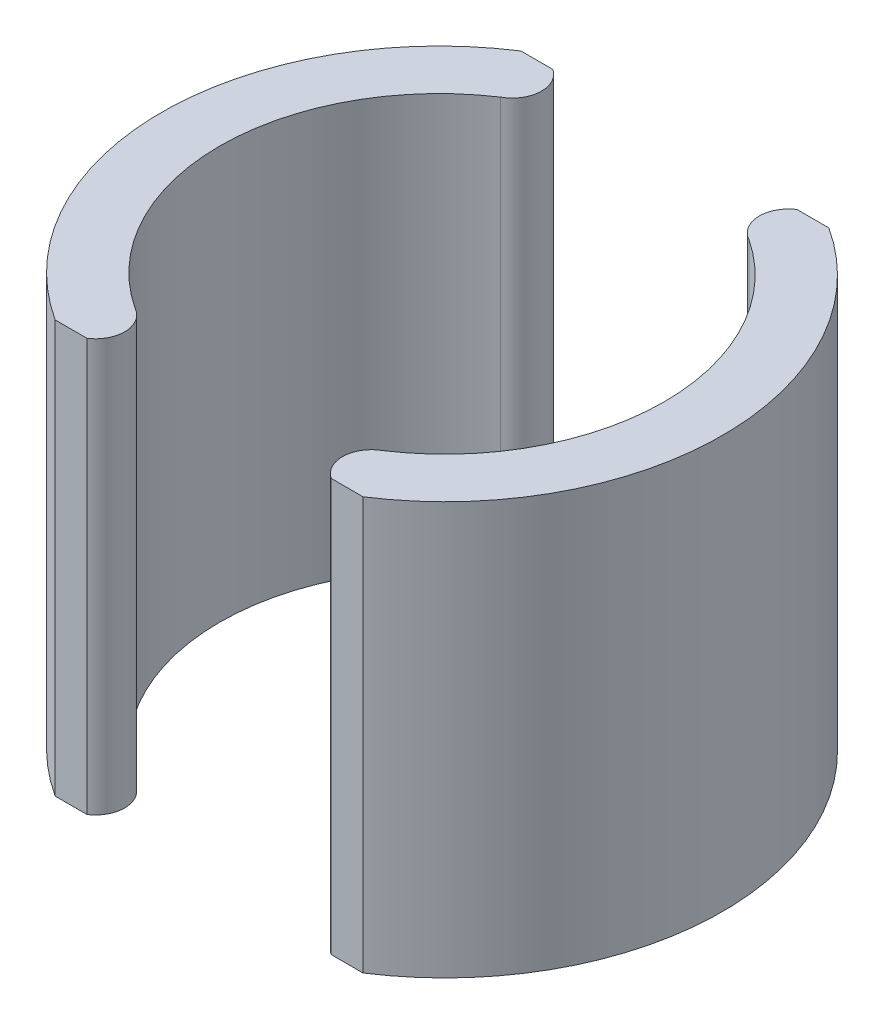
ISO-10303-21;
HEADER;
FILE_DESCRIPTION(('STEP AP214'),'2;1');
FILE_NAME('part.step','',(''),(''),'','','');
FILE_SCHEMA(('AUTOMOTIVE_DESIGN { 1 0 10303 214 1 1 1 1 }'));
ENDSEC;
DATA;
#1=APPLICATION_CONTEXT('core data for automotive mechanical design processes');
#2=APPLICATION_PROTOCOL_DEFINITION('international standard','automotive_design',2000,#1);
#3=PRODUCT_CONTEXT('',#1,'mechanical');
#4=PRODUCT('Part','Part','',(#3));
#5=PRODUCT_RELATED_PRODUCT_CATEGORY('part','',(#4));
#6=PRODUCT_DEFINITION_FORMATION('','',#4);
#7=PRODUCT_DEFINITION_CONTEXT('part definition',#1,'design');
#8=PRODUCT_DEFINITION('design','',#6,#7);
#9=PRODUCT_DEFINITION_SHAPE('','',#8);
#10=(LENGTH_UNIT() NAMED_UNIT(*) SI_UNIT(.MILLI.,.METRE.));
#11=(NAMED_UNIT(*) PLANE_ANGLE_UNIT() SI_UNIT($,.RADIAN.));
#12=(NAMED_UNIT(*) SI_UNIT($,.STERADIAN.) SOLID_ANGLE_UNIT());
#13=UNCERTAINTY_MEASURE_WITH_UNIT(LENGTH_MEASURE(1.E-05),#10,'distance_accuracy_value','');
#14=(GEOMETRIC_REPRESENTATION_CONTEXT(3) GLOBAL_UNCERTAINTY_ASSIGNED_CONTEXT((#13)) GLOBAL_UNIT_ASSIGNED_CONTEXT((#10,
#11,#12)) REPRESENTATION_CONTEXT('',''));
#15=CARTESIAN_POINT('',(0.,0.,0.));
#16=DIRECTION('',(0.,0.,1.));
#17=DIRECTION('',(1.,0.,0.));
#18=AXIS2_PLACEMENT_3D('',#15,#16,#17);
#19=CARTESIAN_POINT('',(-2.49821610331965,-0.01,-4.79217101618151));
#20=DIRECTION('',(0.,0.,-1.));
#21=DIRECTION('',(0.,-1.,0.));
#22=AXIS2_PLACEMENT_3D('',#19,#20,#21);
#23=PLANE('',#22);
#24=DIRECTION('',(-1.,0.,0.));
#25=VECTOR('',#24,1.);
#26=CARTESIAN_POINT('',(-3.99813391326123,8.5,-4.79217101618151));
#27=LINE('',#26,#25);
#28=CARTESIAN_POINT('',(-2.50821610331963,8.5,-4.79217101618151));
#29=VERTEX_POINT('',#28);
#30=CARTESIAN_POINT('',(-3.16458938872502,8.5,-4.79217101618151));
#31=VERTEX_POINT('',#30);
#32=EDGE_CURVE('P0_E86',#29,#31,#27,.T.);
#33=ORIENTED_EDGE('',*,*,#32,.F.);
#34=DIRECTION('',(0.,1.,0.));
#35=VECTOR('',#34,1.);
#36=CARTESIAN_POINT('',(-2.50821610331965,4.25,-4.79217101618151));
#37=LINE('',#36,#35);
#38=CARTESIAN_POINT('',(-2.50821610331963,0.,-4.79217101618151));
#39=VERTEX_POINT('',#38);
#40=EDGE_CURVE('P0_E27',#39,#29,#37,.T.);
#41=ORIENTED_EDGE('',*,*,#40,.F.);
#42=DIRECTION('',(1.,0.,0.));
#43=VECTOR('',#42,1.);
#44=CARTESIAN_POINT('',(-3.99813391326123,0.,-4.79217101618151));
#45=LINE('',#44,#43);
#46=CARTESIAN_POINT('',(-3.16458938872502,0.,-4.79217101618151));
#47=VERTEX_POINT('',#46);
#48=EDGE_CURVE('P0_E11',#47,#39,#45,.T.);
#49=ORIENTED_EDGE('',*,*,#48,.F.);
#50=DIRECTION('',(0.,-1.,0.));
#51=VECTOR('',#50,1.);
#52=CARTESIAN_POINT('',(-3.16458938872502,4.25,-4.79217101618151));
#53=LINE('',#52,#51);
#54=EDGE_CURVE('P0_E125',#31,#47,#53,.T.);
#55=ORIENTED_EDGE('',*,*,#54,.F.);
#56=EDGE_LOOP('',(#33,#41,#49,#55));
#57=FACE_BOUND('',#56,.T.);
#58=ADVANCED_FACE('P0_F16',(#57),#23,.T.);
#59=CARTESIAN_POINT('',(-5.78336442574581,0.,4.81793302896167));
#60=DIRECTION('',(0.,-1.,0.));
#61=DIRECTION('',(0.,0.,-1.));
#62=AXIS2_PLACEMENT_3D('',#59,#60,#61);
#63=PLANE('',#62);
#64=ORIENTED_EDGE('',*,*,#48,.T.);
#65=CARTESIAN_POINT('',(-2.83820806288185,0.,-4.28870778004521));
#66=DIRECTION('',(0.,1.,0.));
#67=DIRECTION('',(0.,0.,-1.));
#68=AXIS2_PLACEMENT_3D('',#65,#66,#67);
#69=CIRCLE('',#68,0.601971696607541);
#70=CARTESIAN_POINT('',(-2.55008175529648,0.,-3.76016908288692));
#71=VERTEX_POINT('',#70);
#72=EDGE_CURVE('P0_E69',#71,#39,#69,.T.);
#73=ORIENTED_EDGE('',*,*,#72,.F.);
#74=CARTESIAN_POINT('',(-0.0528159935486228,0.,0.00793052029908788));
#75=DIRECTION('',(0.,-1.,0.));
#76=DIRECTION('',(0.,0.,1.));
#77=AXIS2_PLACEMENT_3D('',#74,#75,#76);
#78=CIRCLE('',#77,4.52049896630103);
#79=CARTESIAN_POINT('',(-2.55022709263761,0.,3.77593379875784));
#80=VERTEX_POINT('',#79);
#81=EDGE_CURVE('P0_E94',#80,#71,#78,.T.);
#82=ORIENTED_EDGE('',*,*,#81,.F.);
#83=CARTESIAN_POINT('',(-2.83834479259512,0.,4.30448017945267));
#84=DIRECTION('',(0.,-1.,0.));
#85=DIRECTION('',(0.,0.,-1.));
#86=AXIS2_PLACEMENT_3D('',#83,#84,#85);
#87=CIRCLE('',#86,0.601974323019191);
#88=CARTESIAN_POINT('',(-2.5083321960239,0.,4.80793302896167));
#89=VERTEX_POINT('',#88);
#90=EDGE_CURVE('P0_E134',#80,#89,#87,.T.);
#91=ORIENTED_EDGE('',*,*,#90,.T.);
#92=DIRECTION('',(-1.,0.,0.));
#93=VECTOR('',#92,1.);
#94=CARTESIAN_POINT('',(-3.99813391326122,0.,4.80793302896167));
#95=LINE('',#94,#93);
#96=CARTESIAN_POINT('',(-3.16474213989019,0.,4.80793302896167));
#97=VERTEX_POINT('',#96);
#98=EDGE_CURVE('P0_E104',#89,#97,#95,.T.);
#99=ORIENTED_EDGE('',*,*,#98,.T.);
#100=CARTESIAN_POINT('',(-0.0528159935486274,0.,0.00793052029910584));
#101=DIRECTION('',(0.,1.,0.));
#102=DIRECTION('',(0.,0.,-1.));
#103=AXIS2_PLACEMENT_3D('',#100,#101,#102);
#104=CIRCLE('',#103,5.72049896630103);
#105=EDGE_CURVE('P0_E87',#47,#97,#104,.T.);
#106=ORIENTED_EDGE('',*,*,#105,.F.);
#107=EDGE_LOOP('',(#64,#73,#82,#91,#99,#106));
#108=FACE_BOUND('',#107,.T.);
#109=ADVANCED_FACE('P0_F243',(#108),#63,.T.);
#110=CARTESIAN_POINT('',(-2.83820806288185,8.5,-4.28870778004521));
#111=DIRECTION('',(0.,-1.,0.));
#112=DIRECTION('',(0.,0.,-1.));
#113=AXIS2_PLACEMENT_3D('',#110,#111,#112);
#114=CYLINDRICAL_SURFACE('',#113,0.601971696607541);
#115=CARTESIAN_POINT('',(-2.83820806288185,8.5,-4.28870778004521));
#116=DIRECTION('',(0.,1.,0.));
#117=DIRECTION('',(0.,0.,-1.));
#118=AXIS2_PLACEMENT_3D('',#115,#116,#117);
#119=CIRCLE('',#118,0.601971696607541);
#120=CARTESIAN_POINT('',(-2.55008175529648,8.5,-3.76016908288692));
#121=VERTEX_POINT('',#120);
#122=EDGE_CURVE('P0_E78',#121,#29,#119,.T.);
#123=ORIENTED_EDGE('',*,*,#122,.F.);
#124=DIRECTION('',(0.,1.,0.));
#125=VECTOR('',#124,1.);
#126=CARTESIAN_POINT('',(-2.55008175529647,4.25,-3.76016908288692));
#127=LINE('',#126,#125);
#128=EDGE_CURVE('P0_E80',#71,#121,#127,.T.);
#129=ORIENTED_EDGE('',*,*,#128,.F.);
#130=ORIENTED_EDGE('',*,*,#72,.T.);
#131=ORIENTED_EDGE('',*,*,#40,.T.);
#132=EDGE_LOOP('',(#123,#129,#130,#131));
#133=FACE_BOUND('',#132,.T.);
#134=ADVANCED_FACE('P0_F18',(#133),#114,.T.);
#135=CARTESIAN_POINT('',(-5.78336442574581,8.5,-4.80217101618151));
#136=DIRECTION('',(0.,1.,0.));
#137=DIRECTION('',(1.,0.,0.));
#138=AXIS2_PLACEMENT_3D('',#135,#136,#137);
#139=PLANE('',#138);
#140=DIRECTION('',(1.,0.,0.));
#141=VECTOR('',#140,1.);
#142=CARTESIAN_POINT('',(-3.99813391326122,8.5,4.80793302896167));
#143=LINE('',#142,#141);
#144=CARTESIAN_POINT('',(-3.16474213989019,8.5,4.80793302896167));
#145=VERTEX_POINT('',#144);
#146=CARTESIAN_POINT('',(-2.5083321960239,8.5,4.80793302896167));
#147=VERTEX_POINT('',#146);
#148=EDGE_CURVE('P0_E122',#145,#147,#143,.T.);
#149=ORIENTED_EDGE('',*,*,#148,.T.);
#150=CARTESIAN_POINT('',(-2.83834479259512,8.5,4.30448017945267));
#151=DIRECTION('',(0.,1.,0.));
#152=DIRECTION('',(0.,0.,-1.));
#153=AXIS2_PLACEMENT_3D('',#150,#151,#152);
#154=CIRCLE('',#153,0.601974323019191);
#155=CARTESIAN_POINT('',(-2.55022709263761,8.5,3.77593379875784));
#156=VERTEX_POINT('',#155);
#157=EDGE_CURVE('P0_E102',#147,#156,#154,.T.);
#158=ORIENTED_EDGE('',*,*,#157,.T.);
#159=CARTESIAN_POINT('',(-0.0528159935486228,8.5,0.00793052029908788));
#160=DIRECTION('',(0.,1.,0.));
#161=DIRECTION('',(0.,0.,1.));
#162=AXIS2_PLACEMENT_3D('',#159,#160,#161);
#163=CIRCLE('',#162,4.52049896630103);
#164=EDGE_CURVE('P0_E92',#121,#156,#163,.T.);
#165=ORIENTED_EDGE('',*,*,#164,.F.);
#166=ORIENTED_EDGE('',*,*,#122,.T.);
#167=ORIENTED_EDGE('',*,*,#32,.T.);
#168=CARTESIAN_POINT('',(-0.0528159935486274,8.5,0.00793052029910584));
#169=DIRECTION('',(0.,-1.,0.));
#170=DIRECTION('',(0.,0.,-1.));
#171=AXIS2_PLACEMENT_3D('',#168,#169,#170);
#172=CIRCLE('',#171,5.72049896630103);
#173=EDGE_CURVE('P0_E96',#145,#31,#172,.T.);
#174=ORIENTED_EDGE('',*,*,#173,.F.);
#175=EDGE_LOOP('',(#149,#158,#165,#166,#167,#174));
#176=FACE_BOUND('',#175,.T.);
#177=ADVANCED_FACE('P0_F100',(#176),#139,.T.);
#178=CARTESIAN_POINT('',(-0.0528159935486274,8.5,0.00793052029910584));
#179=DIRECTION('',(0.,-1.,0.));
#180=DIRECTION('',(0.,0.,-1.));
#181=AXIS2_PLACEMENT_3D('',#178,#179,#180);
#182=CYLINDRICAL_SURFACE('',#181,5.72049896630103);
#183=ORIENTED_EDGE('',*,*,#173,.T.);
#184=ORIENTED_EDGE('',*,*,#54,.T.);
#185=ORIENTED_EDGE('',*,*,#105,.T.);
#186=DIRECTION('',(0.,-1.,0.));
#187=VECTOR('',#186,1.);
#188=CARTESIAN_POINT('',(-3.16474213989019,4.25,4.80793302896167));
#189=LINE('',#188,#187);
#190=EDGE_CURVE('P0_E114',#145,#97,#189,.T.);
#191=ORIENTED_EDGE('',*,*,#190,.F.);
#192=EDGE_LOOP('',(#183,#184,#185,#191));
#193=FACE_BOUND('',#192,.T.);
#194=ADVANCED_FACE('P0_F156',(#193),#182,.T.);
#195=CARTESIAN_POINT('',(-0.0528159935486228,0.,0.00793052029908788));
#196=DIRECTION('',(0.,1.,0.));
#197=DIRECTION('',(0.,0.,1.));
#198=AXIS2_PLACEMENT_3D('',#195,#196,#197);
#199=CYLINDRICAL_SURFACE('',#198,4.52049896630103);
#200=ORIENTED_EDGE('',*,*,#164,.T.);
#201=DIRECTION('',(0.,1.,0.));
#202=VECTOR('',#201,1.);
#203=CARTESIAN_POINT('',(-2.5502270926377,4.25,3.7759337987578));
#204=LINE('',#203,#202);
#205=EDGE_CURVE('P0_E132',#80,#156,#204,.T.);
#206=ORIENTED_EDGE('',*,*,#205,.F.);
#207=ORIENTED_EDGE('',*,*,#81,.T.);
#208=ORIENTED_EDGE('',*,*,#128,.T.);
#209=EDGE_LOOP('',(#200,#206,#207,#208));
#210=FACE_BOUND('',#209,.T.);
#211=ADVANCED_FACE('P0_F90',(#210),#199,.F.);
#212=CARTESIAN_POINT('',(-3.17474213989019,-0.01,4.80793302896167));
#213=DIRECTION('',(0.,0.,1.));
#214=DIRECTION('',(1.,0.,0.));
#215=AXIS2_PLACEMENT_3D('',#212,#213,#214);
#216=PLANE('',#215);
#217=ORIENTED_EDGE('',*,*,#148,.F.);
#218=ORIENTED_EDGE('',*,*,#190,.T.);
#219=ORIENTED_EDGE('',*,*,#98,.F.);
#220=DIRECTION('',(0.,-1.,0.));
#221=VECTOR('',#220,1.);
#222=CARTESIAN_POINT('',(-2.5083321960239,4.25,4.80793302896167));
#223=LINE('',#222,#221);
#224=EDGE_CURVE('P0_E20',#147,#89,#223,.T.);
#225=ORIENTED_EDGE('',*,*,#224,.F.);
#226=EDGE_LOOP('',(#217,#218,#219,#225));
#227=FACE_BOUND('',#226,.T.);
#228=ADVANCED_FACE('P0_F247',(#227),#216,.T.);
#229=CARTESIAN_POINT('',(-2.83834479259512,8.5,4.30448017945267));
#230=DIRECTION('',(0.,-1.,0.));
#231=DIRECTION('',(0.,0.,-1.));
#232=AXIS2_PLACEMENT_3D('',#229,#230,#231);
#233=CYLINDRICAL_SURFACE('',#232,0.601974323019191);
#234=ORIENTED_EDGE('',*,*,#157,.F.);
#235=ORIENTED_EDGE('',*,*,#224,.T.);
#236=ORIENTED_EDGE('',*,*,#90,.F.);
#237=ORIENTED_EDGE('',*,*,#205,.T.);
#238=EDGE_LOOP('',(#234,#235,#236,#237));
#239=FACE_BOUND('',#238,.T.);
#240=ADVANCED_FACE('P0_F251',(#239),#233,.T.);
#241=CLOSED_SHELL('',(#58,#109,#134,#177,#194,#211,#228,#240));
#242=MANIFOLD_SOLID_BREP('P0_B1',#241);
#243=CARTESIAN_POINT('',(2.49821610331965,-0.01,4.79217101618151));
#244=DIRECTION('',(0.,0.,1.));
#245=DIRECTION('',(1.,0.,0.));
#246=AXIS2_PLACEMENT_3D('',#243,#244,#245);
#247=PLANE('',#246);
#248=DIRECTION('',(1.,0.,0.));
#249=VECTOR('',#248,1.);
#250=CARTESIAN_POINT('',(3.99813391326122,8.5,4.79217101618151));
#251=LINE('',#250,#249);
#252=CARTESIAN_POINT('',(2.50821610331965,8.5,4.79217101618151));
#253=VERTEX_POINT('',#252);
#254=CARTESIAN_POINT('',(3.16458938872502,8.5,4.79217101618151));
#255=VERTEX_POINT('',#254);
#256=EDGE_CURVE('P1_E140',#253,#255,#251,.T.);
#257=ORIENTED_EDGE('',*,*,#256,.F.);
#258=DIRECTION('',(0.,1.,0.));
#259=VECTOR('',#258,1.);
#260=CARTESIAN_POINT('',(2.50821610331965,4.25,4.79217101618151));
#261=LINE('',#260,#259);
#262=CARTESIAN_POINT('',(2.50821610331965,0.,4.79217101618151));
#263=VERTEX_POINT('',#262);
#264=EDGE_CURVE('P1_E27',#263,#253,#261,.T.);
#265=ORIENTED_EDGE('',*,*,#264,.F.);
#266=DIRECTION('',(-1.,0.,0.));
#267=VECTOR('',#266,1.);
#268=CARTESIAN_POINT('',(3.99813391326122,0.,4.79217101618151));
#269=LINE('',#268,#267);
#270=CARTESIAN_POINT('',(3.16458938872502,0.,4.79217101618151));
#271=VERTEX_POINT('',#270);
#272=EDGE_CURVE('P1_E11',#271,#263,#269,.T.);
#273=ORIENTED_EDGE('',*,*,#272,.F.);
#274=DIRECTION('',(0.,-1.,0.));
#275=VECTOR('',#274,1.);
#276=CARTESIAN_POINT('',(3.16458938872502,4.25,4.79217101618151));
#277=LINE('',#276,#275);
#278=EDGE_CURVE('P1_E137',#255,#271,#277,.T.);
#279=ORIENTED_EDGE('',*,*,#278,.F.);
#280=EDGE_LOOP('',(#257,#265,#273,#279));
#281=FACE_BOUND('',#280,.T.);
#282=ADVANCED_FACE('P1_F16',(#281),#247,.T.);
#283=CARTESIAN_POINT('',(5.78336442574581,0.,-4.81793302896167));
#284=DIRECTION('',(0.,-1.,0.));
#285=DIRECTION('',(0.,0.,-1.));
#286=AXIS2_PLACEMENT_3D('',#283,#284,#285);
#287=PLANE('',#286);
#288=ORIENTED_EDGE('',*,*,#272,.T.);
#289=CARTESIAN_POINT('',(2.83820806288183,0.,4.2887077800452));
#290=DIRECTION('',(0.,1.,0.));
#291=DIRECTION('',(0.,0.,-1.));
#292=AXIS2_PLACEMENT_3D('',#289,#290,#291);
#293=CIRCLE('',#292,0.601971696607526);
#294=CARTESIAN_POINT('',(2.55008175529646,0.,3.76016908288693));
#295=VERTEX_POINT('',#294);
#296=EDGE_CURVE('P1_E89',#295,#263,#293,.T.);
#297=ORIENTED_EDGE('',*,*,#296,.F.);
#298=CARTESIAN_POINT('',(0.0528159935486413,0.,-0.00793052029908703));
#299=DIRECTION('',(0.,-1.,0.));
#300=DIRECTION('',(0.,0.,1.));
#301=AXIS2_PLACEMENT_3D('',#298,#299,#300);
#302=CIRCLE('',#301,4.52049896630101);
#303=CARTESIAN_POINT('',(2.55022709263758,0.,-3.77593379875786));
#304=VERTEX_POINT('',#303);
#305=EDGE_CURVE('P1_E82',#304,#295,#302,.T.);
#306=ORIENTED_EDGE('',*,*,#305,.F.);
#307=CARTESIAN_POINT('',(2.83834479259512,0.,-4.30448017945267));
#308=DIRECTION('',(0.,-1.,0.));
#309=DIRECTION('',(0.,0.,-1.));
#310=AXIS2_PLACEMENT_3D('',#307,#308,#309);
#311=CIRCLE('',#310,0.601974323019191);
#312=CARTESIAN_POINT('',(2.5083321960239,0.,-4.80793302896167));
#313=VERTEX_POINT('',#312);
#314=EDGE_CURVE('P1_E86',#304,#313,#311,.T.);
#315=ORIENTED_EDGE('',*,*,#314,.T.);
#316=DIRECTION('',(1.,0.,0.));
#317=VECTOR('',#316,1.);
#318=CARTESIAN_POINT('',(3.99813391326123,0.,-4.80793302896167));
#319=LINE('',#318,#317);
#320=CARTESIAN_POINT('',(3.16474213989019,0.,-4.80793302896167));
#321=VERTEX_POINT('',#320);
#322=EDGE_CURVE('P1_E124',#313,#321,#319,.T.);
#323=ORIENTED_EDGE('',*,*,#322,.T.);
#324=CARTESIAN_POINT('',(0.0528159935486274,0.,-0.00793052029910612));
#325=DIRECTION('',(0.,1.,0.));
#326=DIRECTION('',(0.,0.,-1.));
#327=AXIS2_PLACEMENT_3D('',#324,#325,#326);
#328=CIRCLE('',#327,5.72049896630103);
#329=EDGE_CURVE('P1_E147',#271,#321,#328,.T.);
#330=ORIENTED_EDGE('',*,*,#329,.F.);
#331=EDGE_LOOP('',(#288,#297,#306,#315,#323,#330));
#332=FACE_BOUND('',#331,.T.);
#333=ADVANCED_FACE('P1_F18',(#332),#287,.T.);
#334=CARTESIAN_POINT('',(2.83820806288183,8.5,4.2887077800452));
#335=DIRECTION('',(0.,-1.,0.));
#336=DIRECTION('',(0.,0.,-1.));
#337=AXIS2_PLACEMENT_3D('',#334,#335,#336);
#338=CYLINDRICAL_SURFACE('',#337,0.601971696607526);
#339=CARTESIAN_POINT('',(2.83820806288183,8.5,4.2887077800452));
#340=DIRECTION('',(0.,1.,0.));
#341=DIRECTION('',(0.,0.,-1.));
#342=AXIS2_PLACEMENT_3D('',#339,#340,#341);
#343=CIRCLE('',#342,0.601971696607526);
#344=CARTESIAN_POINT('',(2.55008175529646,8.5,3.76016908288693));
#345=VERTEX_POINT('',#344);
#346=EDGE_CURVE('P1_E20',#345,#253,#343,.T.);
#347=ORIENTED_EDGE('',*,*,#346,.F.);
#348=DIRECTION('',(0.,1.,0.));
#349=VECTOR('',#348,1.);
#350=CARTESIAN_POINT('',(2.55008175529647,4.25,3.76016908288692));
#351=LINE('',#350,#349);
#352=EDGE_CURVE('P1_E94',#295,#345,#351,.T.);
#353=ORIENTED_EDGE('',*,*,#352,.F.);
#354=ORIENTED_EDGE('',*,*,#296,.T.);
#355=ORIENTED_EDGE('',*,*,#264,.T.);
#356=EDGE_LOOP('',(#347,#353,#354,#355));
#357=FACE_BOUND('',#356,.T.);
#358=ADVANCED_FACE('P1_F163',(#357),#338,.T.);
#359=CARTESIAN_POINT('',(5.78336442574581,8.5,4.80217101618151));
#360=DIRECTION('',(0.,1.,0.));
#361=DIRECTION('',(1.,0.,0.));
#362=AXIS2_PLACEMENT_3D('',#359,#360,#361);
#363=PLANE('',#362);
#364=DIRECTION('',(-1.,0.,0.));
#365=VECTOR('',#364,1.);
#366=CARTESIAN_POINT('',(3.99813391326123,8.5,-4.80793302896167));
#367=LINE('',#366,#365);
#368=CARTESIAN_POINT('',(3.16474213989019,8.5,-4.80793302896167));
#369=VERTEX_POINT('',#368);
#370=CARTESIAN_POINT('',(2.5083321960239,8.5,-4.80793302896167));
#371=VERTEX_POINT('',#370);
#372=EDGE_CURVE('P1_E105',#369,#371,#367,.T.);
#373=ORIENTED_EDGE('',*,*,#372,.T.);
#374=CARTESIAN_POINT('',(2.83834479259512,8.5,-4.30448017945267));
#375=DIRECTION('',(0.,1.,0.));
#376=DIRECTION('',(0.,0.,-1.));
#377=AXIS2_PLACEMENT_3D('',#374,#375,#376);
#378=CIRCLE('',#377,0.601974323019191);
#379=CARTESIAN_POINT('',(2.55022709263758,8.5,-3.77593379875786));
#380=VERTEX_POINT('',#379);
#381=EDGE_CURVE('P1_E115',#371,#380,#378,.T.);
#382=ORIENTED_EDGE('',*,*,#381,.T.);
#383=CARTESIAN_POINT('',(0.0528159935486413,8.5,-0.00793052029908703));
#384=DIRECTION('',(0.,1.,0.));
#385=DIRECTION('',(0.,0.,1.));
#386=AXIS2_PLACEMENT_3D('',#383,#384,#385);
#387=CIRCLE('',#386,4.52049896630101);
#388=EDGE_CURVE('P1_E95',#345,#380,#387,.T.);
#389=ORIENTED_EDGE('',*,*,#388,.F.);
#390=ORIENTED_EDGE('',*,*,#346,.T.);
#391=ORIENTED_EDGE('',*,*,#256,.T.);
#392=CARTESIAN_POINT('',(0.0528159935486274,8.5,-0.00793052029910612));
#393=DIRECTION('',(0.,-1.,0.));
#394=DIRECTION('',(0.,0.,-1.));
#395=AXIS2_PLACEMENT_3D('',#392,#393,#394);
#396=CIRCLE('',#395,5.72049896630103);
#397=EDGE_CURVE('P1_E133',#369,#255,#396,.T.);
#398=ORIENTED_EDGE('',*,*,#397,.F.);
#399=EDGE_LOOP('',(#373,#382,#389,#390,#391,#398));
#400=FACE_BOUND('',#399,.T.);
#401=ADVANCED_FACE('P1_F159',(#400),#363,.T.);
#402=CARTESIAN_POINT('',(0.0528159935486274,8.5,-0.00793052029910612));
#403=DIRECTION('',(0.,-1.,0.));
#404=DIRECTION('',(0.,0.,-1.));
#405=AXIS2_PLACEMENT_3D('',#402,#403,#404);
#406=CYLINDRICAL_SURFACE('',#405,5.72049896630103);
#407=ORIENTED_EDGE('',*,*,#397,.T.);
#408=ORIENTED_EDGE('',*,*,#278,.T.);
#409=ORIENTED_EDGE('',*,*,#329,.T.);
#410=DIRECTION('',(0.,-1.,0.));
#411=VECTOR('',#410,1.);
#412=CARTESIAN_POINT('',(3.16474213989019,4.25,-4.80793302896167));
#413=LINE('',#412,#411);
#414=EDGE_CURVE('P1_E120',#369,#321,#413,.T.);
#415=ORIENTED_EDGE('',*,*,#414,.F.);
#416=EDGE_LOOP('',(#407,#408,#409,#415));
#417=FACE_BOUND('',#416,.T.);
#418=ADVANCED_FACE('P1_F165',(#417),#406,.T.);
#419=CARTESIAN_POINT('',(0.0528159935486413,0.,-0.00793052029908703));
#420=DIRECTION('',(0.,1.,0.));
#421=DIRECTION('',(0.,0.,1.));
#422=AXIS2_PLACEMENT_3D('',#419,#420,#421);
#423=CYLINDRICAL_SURFACE('',#422,4.52049896630101);
#424=ORIENTED_EDGE('',*,*,#388,.T.);
#425=DIRECTION('',(0.,1.,0.));
#426=VECTOR('',#425,1.);
#427=CARTESIAN_POINT('',(2.5502270926377,4.25,-3.77593379875779));
#428=LINE('',#427,#426);
#429=EDGE_CURVE('P1_E98',#304,#380,#428,.T.);
#430=ORIENTED_EDGE('',*,*,#429,.F.);
#431=ORIENTED_EDGE('',*,*,#305,.T.);
#432=ORIENTED_EDGE('',*,*,#352,.T.);
#433=EDGE_LOOP('',(#424,#430,#431,#432));
#434=FACE_BOUND('',#433,.T.);
#435=ADVANCED_FACE('P1_F99',(#434),#423,.F.);
#436=CARTESIAN_POINT('',(3.17474213989019,-0.01,-4.80793302896167));
#437=DIRECTION('',(0.,0.,-1.));
#438=DIRECTION('',(0.,-1.,0.));
#439=AXIS2_PLACEMENT_3D('',#436,#437,#438);
#440=PLANE('',#439);
#441=ORIENTED_EDGE('',*,*,#372,.F.);
#442=ORIENTED_EDGE('',*,*,#414,.T.);
#443=ORIENTED_EDGE('',*,*,#322,.F.);
#444=DIRECTION('',(0.,-1.,0.));
#445=VECTOR('',#444,1.);
#446=CARTESIAN_POINT('',(2.5083321960239,4.25,-4.80793302896167));
#447=LINE('',#446,#445);
#448=EDGE_CURVE('P1_E109',#371,#313,#447,.T.);
#449=ORIENTED_EDGE('',*,*,#448,.F.);
#450=EDGE_LOOP('',(#441,#442,#443,#449));
#451=FACE_BOUND('',#450,.T.);
#452=ADVANCED_FACE('P1_F168',(#451),#440,.T.);
#453=CARTESIAN_POINT('',(2.83834479259512,8.5,-4.30448017945267));
#454=DIRECTION('',(0.,-1.,0.));
#455=DIRECTION('',(0.,0.,-1.));
#456=AXIS2_PLACEMENT_3D('',#453,#454,#455);
#457=CYLINDRICAL_SURFACE('',#456,0.601974323019191);
#458=ORIENTED_EDGE('',*,*,#381,.F.);
#459=ORIENTED_EDGE('',*,*,#448,.T.);
#460=ORIENTED_EDGE('',*,*,#314,.F.);
#461=ORIENTED_EDGE('',*,*,#429,.T.);
#462=EDGE_LOOP('',(#458,#459,#460,#461));
#463=FACE_BOUND('',#462,.T.);
#464=ADVANCED_FACE('P1_F107',(#463),#457,.T.);
#465=CLOSED_SHELL('',(#282,#333,#358,#401,#418,#435,#452,#464));
#466=MANIFOLD_SOLID_BREP('P1_B1',#465);
#467=ADVANCED_BREP_SHAPE_REPRESENTATION('',(#18,#242,#466),#14);
#468=SHAPE_DEFINITION_REPRESENTATION(#9,#467);
ENDSEC;
END-ISO-10303-21;
